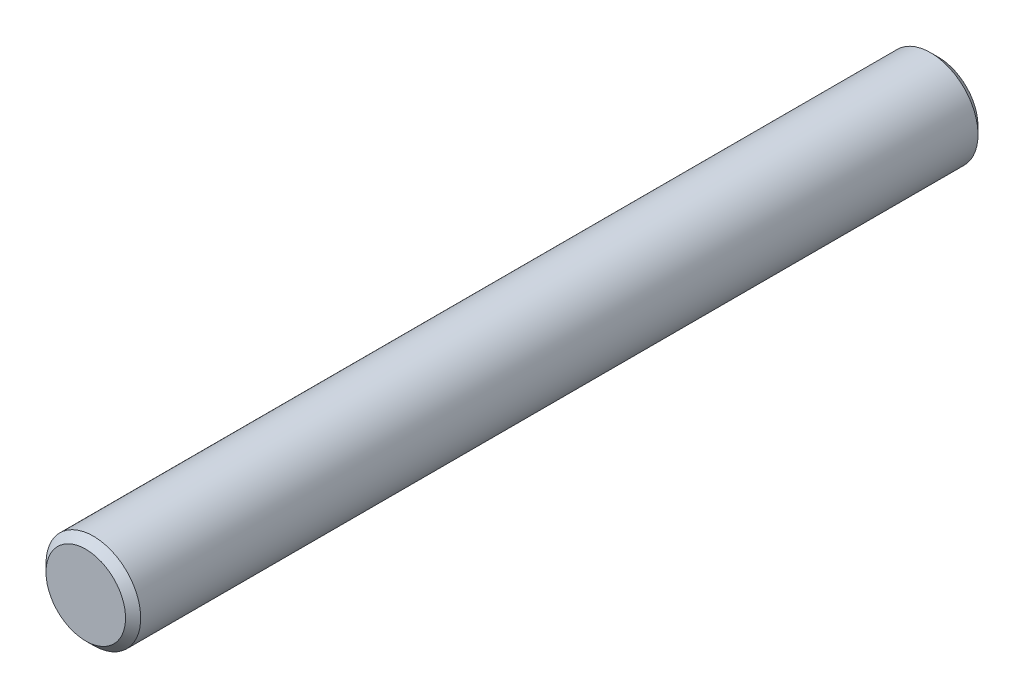
ISO-10303-21;
HEADER;
FILE_DESCRIPTION(('STEP AP214'),'2;1');
FILE_NAME('part.step','',(''),(''),'','','');
FILE_SCHEMA(('AUTOMOTIVE_DESIGN { 1 0 10303 214 1 1 1 1 }'));
ENDSEC;
DATA;
#1=APPLICATION_CONTEXT('core data for automotive mechanical design processes');
#2=APPLICATION_PROTOCOL_DEFINITION('international standard','automotive_design',2000,#1);
#3=PRODUCT_CONTEXT('',#1,'mechanical');
#4=PRODUCT('Part','Part','',(#3));
#5=PRODUCT_RELATED_PRODUCT_CATEGORY('part','',(#4));
#6=PRODUCT_DEFINITION_FORMATION('','',#4);
#7=PRODUCT_DEFINITION_CONTEXT('part definition',#1,'design');
#8=PRODUCT_DEFINITION('design','',#6,#7);
#9=PRODUCT_DEFINITION_SHAPE('','',#8);
#10=(LENGTH_UNIT() NAMED_UNIT(*) SI_UNIT(.MILLI.,.METRE.));
#11=(NAMED_UNIT(*) PLANE_ANGLE_UNIT() SI_UNIT($,.RADIAN.));
#12=(NAMED_UNIT(*) SI_UNIT($,.STERADIAN.) SOLID_ANGLE_UNIT());
#13=UNCERTAINTY_MEASURE_WITH_UNIT(LENGTH_MEASURE(1.E-05),#10,'distance_accuracy_value','');
#14=(GEOMETRIC_REPRESENTATION_CONTEXT(3) GLOBAL_UNCERTAINTY_ASSIGNED_CONTEXT((#13)) GLOBAL_UNIT_ASSIGNED_CONTEXT((#10,
#11,#12)) REPRESENTATION_CONTEXT('',''));
#15=CARTESIAN_POINT('',(0.,0.,0.));
#16=DIRECTION('',(0.,0.,1.));
#17=DIRECTION('',(1.,0.,0.));
#18=AXIS2_PLACEMENT_3D('',#15,#16,#17);
#19=CARTESIAN_POINT('',(0.,0.,45.));
#20=DIRECTION('',(0.,0.,1.));
#21=DIRECTION('',(1.,0.,0.));
#22=AXIS2_PLACEMENT_3D('',#19,#20,#21);
#23=PLANE('',#22);
#24=CARTESIAN_POINT('',(0.,0.,45.0000000000159));
#25=DIRECTION('',(0.,0.,-1.));
#26=DIRECTION('',(-1.,0.,0.));
#27=AXIS2_PLACEMENT_3D('',#24,#25,#26);
#28=CIRCLE('',#27,2.0999999999276);
#29=CARTESIAN_POINT('',(-2.0999999999276,0.,45.0000000000159));
#30=VERTEX_POINT('',#29);
#31=EDGE_CURVE('E18',#30,#30,#28,.T.);
#32=ORIENTED_EDGE('',*,*,#31,.F.);
#33=EDGE_LOOP('',(#32));
#34=FACE_BOUND('',#33,.T.);
#35=ADVANCED_FACE('F15',(#34),#23,.T.);
#36=CARTESIAN_POINT('',(0.,0.,0.));
#37=DIRECTION('',(0.,0.,1.));
#38=DIRECTION('',(1.,0.,0.));
#39=AXIS2_PLACEMENT_3D('',#36,#37,#38);
#40=PLANE('',#39);
#41=CARTESIAN_POINT('',(0.,0.,0.));
#42=DIRECTION('',(0.,0.,1.));
#43=DIRECTION('',(0.,-1.,0.));
#44=AXIS2_PLACEMENT_3D('',#41,#42,#43);
#45=CIRCLE('',#44,2.09999999998445);
#46=CARTESIAN_POINT('',(0.,-2.09999999998445,0.));
#47=VERTEX_POINT('',#46);
#48=EDGE_CURVE('E27',#47,#47,#45,.T.);
#49=ORIENTED_EDGE('',*,*,#48,.F.);
#50=EDGE_LOOP('',(#49));
#51=FACE_BOUND('',#50,.T.);
#52=ADVANCED_FACE('F38',(#51),#40,.F.);
#53=CARTESIAN_POINT('',(0.,0.,44.5999999999458));
#54=DIRECTION('',(0.,0.,-1.));
#55=DIRECTION('',(-1.,0.,0.));
#56=AXIS2_PLACEMENT_3D('',#53,#54,#55);
#57=CONICAL_SURFACE('',#56,2.49999999999773,0.785398163397448);
#58=CARTESIAN_POINT('',(0.,0.,44.6));
#59=DIRECTION('',(0.,0.,-1.));
#60=DIRECTION('',(-1.,0.,0.));
#61=AXIS2_PLACEMENT_3D('',#58,#59,#60);
#62=CIRCLE('',#61,2.5);
#63=CARTESIAN_POINT('',(-2.5,0.,44.6));
#64=VERTEX_POINT('',#63);
#65=EDGE_CURVE('E22',#64,#64,#62,.T.);
#66=ORIENTED_EDGE('',*,*,#65,.F.);
#67=EDGE_LOOP('',(#66));
#68=FACE_BOUND('',#67,.T.);
#69=ORIENTED_EDGE('',*,*,#31,.T.);
#70=EDGE_LOOP('',(#69));
#71=FACE_BOUND('',#70,.T.);
#72=ADVANCED_FACE('F35',(#68,#71),#57,.T.);
#73=CARTESIAN_POINT('',(0.,0.,0.399999999899592));
#74=DIRECTION('',(0.,0.,1.));
#75=DIRECTION('',(0.,-1.,0.));
#76=AXIS2_PLACEMENT_3D('',#73,#74,#75);
#77=CONICAL_SURFACE('',#76,2.49999999988404,0.785398163397448);
#78=CARTESIAN_POINT('',(0.,0.,0.400000000000046));
#79=DIRECTION('',(0.,0.,-1.));
#80=DIRECTION('',(-1.,0.,0.));
#81=AXIS2_PLACEMENT_3D('',#78,#79,#80);
#82=CIRCLE('',#81,2.5);
#83=CARTESIAN_POINT('',(-2.5,0.,0.400000000000046));
#84=VERTEX_POINT('',#83);
#85=EDGE_CURVE('E10',#84,#84,#82,.F.);
#86=ORIENTED_EDGE('',*,*,#85,.F.);
#87=EDGE_LOOP('',(#86));
#88=FACE_BOUND('',#87,.T.);
#89=ORIENTED_EDGE('',*,*,#48,.T.);
#90=EDGE_LOOP('',(#89));
#91=FACE_BOUND('',#90,.T.);
#92=ADVANCED_FACE('F46',(#88,#91),#77,.T.);
#93=CARTESIAN_POINT('',(0.,0.,45.));
#94=DIRECTION('',(0.,0.,-1.));
#95=DIRECTION('',(-1.,0.,0.));
#96=AXIS2_PLACEMENT_3D('',#93,#94,#95);
#97=CYLINDRICAL_SURFACE('',#96,2.5);
#98=ORIENTED_EDGE('',*,*,#85,.T.);
#99=EDGE_LOOP('',(#98));
#100=FACE_BOUND('',#99,.T.);
#101=ORIENTED_EDGE('',*,*,#65,.T.);
#102=EDGE_LOOP('',(#101));
#103=FACE_BOUND('',#102,.T.);
#104=ADVANCED_FACE('F44',(#100,#103),#97,.T.);
#105=CLOSED_SHELL('',(#35,#52,#72,#92,#104));
#106=MANIFOLD_SOLID_BREP('B1',#105);
#107=ADVANCED_BREP_SHAPE_REPRESENTATION('',(#18,#106),#14);
#108=SHAPE_DEFINITION_REPRESENTATION(#9,#107);
ENDSEC;
END-ISO-10303-21;
